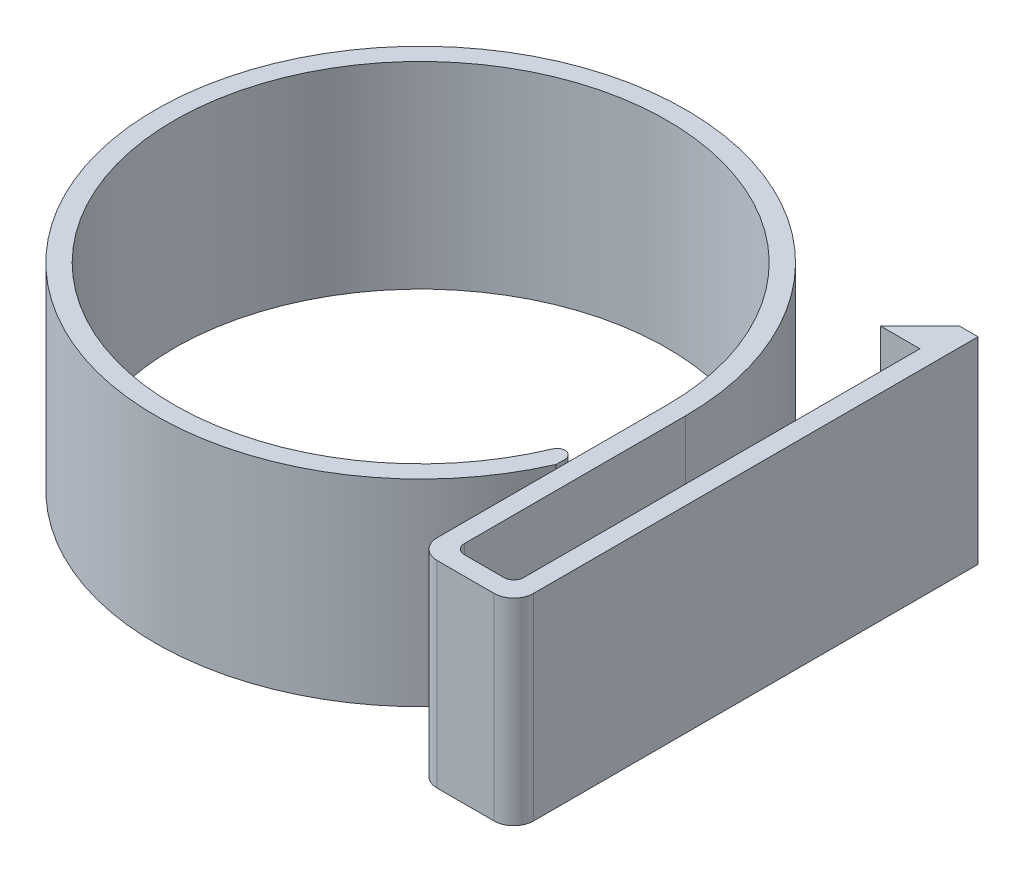
ISO-10303-21;
HEADER;
FILE_DESCRIPTION(('STEP AP214'),'2;1');
FILE_NAME('part.step','',(''),(''),'','','');
FILE_SCHEMA(('AUTOMOTIVE_DESIGN { 1 0 10303 214 1 1 1 1 }'));
ENDSEC;
DATA;
#1=APPLICATION_CONTEXT('core data for automotive mechanical design processes');
#2=APPLICATION_PROTOCOL_DEFINITION('international standard','automotive_design',2000,#1);
#3=PRODUCT_CONTEXT('',#1,'mechanical');
#4=PRODUCT('Part','Part','',(#3));
#5=PRODUCT_RELATED_PRODUCT_CATEGORY('part','',(#4));
#6=PRODUCT_DEFINITION_FORMATION('','',#4);
#7=PRODUCT_DEFINITION_CONTEXT('part definition',#1,'design');
#8=PRODUCT_DEFINITION('design','',#6,#7);
#9=PRODUCT_DEFINITION_SHAPE('','',#8);
#10=(LENGTH_UNIT() NAMED_UNIT(*) SI_UNIT(.MILLI.,.METRE.));
#11=(NAMED_UNIT(*) PLANE_ANGLE_UNIT() SI_UNIT($,.RADIAN.));
#12=(NAMED_UNIT(*) SI_UNIT($,.STERADIAN.) SOLID_ANGLE_UNIT());
#13=UNCERTAINTY_MEASURE_WITH_UNIT(LENGTH_MEASURE(1.E-05),#10,'distance_accuracy_value','');
#14=(GEOMETRIC_REPRESENTATION_CONTEXT(3) GLOBAL_UNCERTAINTY_ASSIGNED_CONTEXT((#13)) GLOBAL_UNIT_ASSIGNED_CONTEXT((#10,
#11,#12)) REPRESENTATION_CONTEXT('',''));
#15=CARTESIAN_POINT('',(0.,0.,0.));
#16=DIRECTION('',(0.,0.,1.));
#17=DIRECTION('',(1.,0.,0.));
#18=AXIS2_PLACEMENT_3D('',#15,#16,#17);
#19=CARTESIAN_POINT('',(20.885,12.7,-10.5145716596755));
#20=DIRECTION('',(1.,0.,0.));
#21=DIRECTION('',(0.,0.,-1.));
#22=AXIS2_PLACEMENT_3D('',#19,#20,#21);
#23=PLANE('',#22);
#24=DIRECTION('',(0.,0.,1.));
#25=VECTOR('',#24,1.);
#26=CARTESIAN_POINT('',(20.885,0.,-10.5145716596755));
#27=LINE('',#26,#25);
#28=CARTESIAN_POINT('',(20.885,0.,-11.2765716596755));
#29=VERTEX_POINT('',#28);
#30=CARTESIAN_POINT('',(20.885,0.,14.2504283403245));
#31=VERTEX_POINT('',#30);
#32=EDGE_CURVE('E217',#29,#31,#27,.T.);
#33=ORIENTED_EDGE('',*,*,#32,.T.);
#34=DIRECTION('',(0.,-1.,0.));
#35=VECTOR('',#34,1.);
#36=CARTESIAN_POINT('',(20.885,12.7,14.2504283403245));
#37=LINE('',#36,#35);
#38=CARTESIAN_POINT('',(20.885,12.7,14.2504283403245));
#39=VERTEX_POINT('',#38);
#40=EDGE_CURVE('E285',#31,#39,#37,.F.);
#41=ORIENTED_EDGE('',*,*,#40,.T.);
#42=DIRECTION('',(0.,0.,1.));
#43=VECTOR('',#42,1.);
#44=CARTESIAN_POINT('',(20.885,12.7,-11.2765716596755));
#45=LINE('',#44,#43);
#46=CARTESIAN_POINT('',(20.885,12.7,-11.2765716596755));
#47=VERTEX_POINT('',#46);
#48=EDGE_CURVE('E257',#47,#39,#45,.T.);
#49=ORIENTED_EDGE('',*,*,#48,.F.);
#50=DIRECTION('',(0.,-1.,0.));
#51=VECTOR('',#50,1.);
#52=CARTESIAN_POINT('',(20.885,12.7,-11.2765716596755));
#53=LINE('',#52,#51);
#54=EDGE_CURVE('E216',#47,#29,#53,.T.);
#55=ORIENTED_EDGE('',*,*,#54,.T.);
#56=EDGE_LOOP('',(#33,#41,#49,#55));
#57=FACE_BOUND('',#56,.T.);
#58=ADVANCED_FACE('F39',(#57),#23,.F.);
#59=CARTESIAN_POINT('',(20.885,12.7,14.8854283403245));
#60=DIRECTION('',(0.,0.,1.));
#61=DIRECTION('',(1.,0.,0.));
#62=AXIS2_PLACEMENT_3D('',#59,#60,#61);
#63=PLANE('',#62);
#64=DIRECTION('',(-1.,0.,0.));
#65=VECTOR('',#64,1.);
#66=CARTESIAN_POINT('',(20.885,12.7,14.8854283403245));
#67=LINE('',#66,#65);
#68=CARTESIAN_POINT('',(20.25,12.7,14.8854283403245));
#69=VERTEX_POINT('',#68);
#70=CARTESIAN_POINT('',(17.71,12.7,14.8854283403245));
#71=VERTEX_POINT('',#70);
#72=EDGE_CURVE('E171',#69,#71,#67,.T.);
#73=ORIENTED_EDGE('',*,*,#72,.F.);
#74=DIRECTION('',(0.,-1.,0.));
#75=VECTOR('',#74,1.);
#76=CARTESIAN_POINT('',(20.25,0.,14.8854283403245));
#77=LINE('',#76,#75);
#78=CARTESIAN_POINT('',(20.25,0.,14.8854283403245));
#79=VERTEX_POINT('',#78);
#80=EDGE_CURVE('E281',#69,#79,#77,.T.);
#81=ORIENTED_EDGE('',*,*,#80,.T.);
#82=DIRECTION('',(-1.,0.,0.));
#83=VECTOR('',#82,1.);
#84=CARTESIAN_POINT('',(20.885,0.,14.8854283403245));
#85=LINE('',#84,#83);
#86=CARTESIAN_POINT('',(17.71,0.,14.8854283403245));
#87=VERTEX_POINT('',#86);
#88=EDGE_CURVE('E221',#79,#87,#85,.T.);
#89=ORIENTED_EDGE('',*,*,#88,.T.);
#90=DIRECTION('',(0.,-1.,0.));
#91=VECTOR('',#90,1.);
#92=CARTESIAN_POINT('',(17.71,12.7,14.8854283403245));
#93=LINE('',#92,#91);
#94=EDGE_CURVE('E181',#87,#71,#93,.F.);
#95=ORIENTED_EDGE('',*,*,#94,.T.);
#96=EDGE_LOOP('',(#73,#81,#89,#95));
#97=FACE_BOUND('',#96,.T.);
#98=ADVANCED_FACE('F401',(#97),#63,.F.);
#99=CARTESIAN_POINT('',(17.075,12.7,0.));
#100=DIRECTION('',(-1.,0.,0.));
#101=DIRECTION('',(0.,0.,1.));
#102=AXIS2_PLACEMENT_3D('',#99,#100,#101);
#103=PLANE('',#102);
#104=DIRECTION('',(0.,0.,-1.));
#105=VECTOR('',#104,1.);
#106=CARTESIAN_POINT('',(17.075,12.7,0.));
#107=LINE('',#106,#105);
#108=CARTESIAN_POINT('',(17.075,12.7,14.2504283403245));
#109=VERTEX_POINT('',#108);
#110=CARTESIAN_POINT('',(17.075,12.7,0.));
#111=VERTEX_POINT('',#110);
#112=EDGE_CURVE('E158',#109,#111,#107,.T.);
#113=ORIENTED_EDGE('',*,*,#112,.F.);
#114=DIRECTION('',(0.,-1.,0.));
#115=VECTOR('',#114,1.);
#116=CARTESIAN_POINT('',(17.075,0.,14.2504283403245));
#117=LINE('',#116,#115);
#118=CARTESIAN_POINT('',(17.075,0.,14.2504283403245));
#119=VERTEX_POINT('',#118);
#120=EDGE_CURVE('E288',#109,#119,#117,.T.);
#121=ORIENTED_EDGE('',*,*,#120,.T.);
#122=DIRECTION('',(0.,0.,-1.));
#123=VECTOR('',#122,1.);
#124=CARTESIAN_POINT('',(17.075,0.,0.));
#125=LINE('',#124,#123);
#126=CARTESIAN_POINT('',(17.075,0.,0.));
#127=VERTEX_POINT('',#126);
#128=EDGE_CURVE('E177',#119,#127,#125,.T.);
#129=ORIENTED_EDGE('',*,*,#128,.T.);
#130=DIRECTION('',(0.,-1.,0.));
#131=VECTOR('',#130,1.);
#132=CARTESIAN_POINT('',(17.075,12.7,0.));
#133=LINE('',#132,#131);
#134=EDGE_CURVE('E174',#111,#127,#133,.T.);
#135=ORIENTED_EDGE('',*,*,#134,.F.);
#136=EDGE_LOOP('',(#113,#121,#129,#135));
#137=FACE_BOUND('',#136,.T.);
#138=ADVANCED_FACE('F175',(#137),#103,.F.);
#139=CARTESIAN_POINT('',(0.,12.7,0.));
#140=DIRECTION('',(0.,-1.,0.));
#141=DIRECTION('',(0.,0.,-1.));
#142=AXIS2_PLACEMENT_3D('',#139,#140,#141);
#143=CYLINDRICAL_SURFACE('',#142,17.075);
#144=CARTESIAN_POINT('',(0.,0.,0.));
#145=DIRECTION('',(0.,1.,0.));
#146=DIRECTION('',(0.,0.,1.));
#147=AXIS2_PLACEMENT_3D('',#144,#145,#146);
#148=CIRCLE('',#147,17.075);
#149=CARTESIAN_POINT('',(15.621,0.,6.89492451010161));
#150=VERTEX_POINT('',#149);
#151=EDGE_CURVE('E227',#127,#150,#148,.T.);
#152=ORIENTED_EDGE('',*,*,#151,.T.);
#153=DIRECTION('',(0.,-1.,0.));
#154=VECTOR('',#153,1.);
#155=CARTESIAN_POINT('',(15.621,12.7,6.89492451010161));
#156=LINE('',#155,#154);
#157=CARTESIAN_POINT('',(15.621,12.7,6.89492451010161));
#158=VERTEX_POINT('',#157);
#159=EDGE_CURVE('E182',#158,#150,#156,.T.);
#160=ORIENTED_EDGE('',*,*,#159,.F.);
#161=CARTESIAN_POINT('',(0.,12.7,0.));
#162=DIRECTION('',(0.,1.,0.));
#163=DIRECTION('',(0.,0.,1.));
#164=AXIS2_PLACEMENT_3D('',#161,#162,#163);
#165=CIRCLE('',#164,17.075);
#166=EDGE_CURVE('E162',#111,#158,#165,.T.);
#167=ORIENTED_EDGE('',*,*,#166,.F.);
#168=ORIENTED_EDGE('',*,*,#134,.T.);
#169=EDGE_LOOP('',(#152,#160,#167,#168));
#170=FACE_BOUND('',#169,.T.);
#171=ADVANCED_FACE('F184',(#170),#143,.T.);
#172=CARTESIAN_POINT('',(15.621,12.7,6.89492451010161));
#173=DIRECTION('',(-1.,0.,0.));
#174=DIRECTION('',(0.,0.,1.));
#175=AXIS2_PLACEMENT_3D('',#172,#173,#174);
#176=PLANE('',#175);
#177=DIRECTION('',(0.,0.,-1.));
#178=VECTOR('',#177,1.);
#179=CARTESIAN_POINT('',(15.621,0.,6.89492451010161));
#180=LINE('',#179,#178);
#181=CARTESIAN_POINT('',(15.621,0.,6.32454899577828));
#182=VERTEX_POINT('',#181);
#183=EDGE_CURVE('E230',#150,#182,#180,.T.);
#184=ORIENTED_EDGE('',*,*,#183,.T.);
#185=DIRECTION('',(0.,-1.,0.));
#186=VECTOR('',#185,1.);
#187=CARTESIAN_POINT('',(15.621,12.7,6.32454899577828));
#188=LINE('',#187,#186);
#189=CARTESIAN_POINT('',(15.621,12.7,6.32454899577828));
#190=VERTEX_POINT('',#189);
#191=EDGE_CURVE('E48',#182,#190,#188,.F.);
#192=ORIENTED_EDGE('',*,*,#191,.T.);
#193=DIRECTION('',(0.,0.,-1.));
#194=VECTOR('',#193,1.);
#195=CARTESIAN_POINT('',(15.621,12.7,6.89492451010161));
#196=LINE('',#195,#194);
#197=EDGE_CURVE('E187',#158,#190,#196,.T.);
#198=ORIENTED_EDGE('',*,*,#197,.F.);
#199=ORIENTED_EDGE('',*,*,#159,.T.);
#200=EDGE_LOOP('',(#184,#192,#198,#199));
#201=FACE_BOUND('',#200,.T.);
#202=ADVANCED_FACE('F395',(#201),#176,.F.);
#203=CARTESIAN_POINT('',(0.,12.7,0.));
#204=DIRECTION('',(0.,-1.,0.));
#205=DIRECTION('',(0.,0.,-1.));
#206=AXIS2_PLACEMENT_3D('',#203,#204,#205);
#207=CYLINDRICAL_SURFACE('',#206,15.875);
#208=CARTESIAN_POINT('',(0.,12.7,0.));
#209=DIRECTION('',(0.,-1.,0.));
#210=DIRECTION('',(0.,0.,1.));
#211=AXIS2_PLACEMENT_3D('',#208,#209,#210);
#212=CIRCLE('',#211,15.875);
#213=CARTESIAN_POINT('',(14.6443798449612,12.7,6.12843894939755));
#214=VERTEX_POINT('',#213);
#215=CARTESIAN_POINT('',(15.875,12.7,0.));
#216=VERTEX_POINT('',#215);
#217=EDGE_CURVE('E190',#214,#216,#212,.T.);
#218=ORIENTED_EDGE('',*,*,#217,.F.);
#219=DIRECTION('',(0.,-1.,0.));
#220=VECTOR('',#219,1.);
#221=CARTESIAN_POINT('',(14.6443798449612,12.7,6.12843894939756));
#222=LINE('',#221,#220);
#223=CARTESIAN_POINT('',(14.6443798449612,0.,6.12843894939755));
#224=VERTEX_POINT('',#223);
#225=EDGE_CURVE('E328',#214,#224,#222,.T.);
#226=ORIENTED_EDGE('',*,*,#225,.T.);
#227=CARTESIAN_POINT('',(0.,0.,0.));
#228=DIRECTION('',(0.,-1.,0.));
#229=DIRECTION('',(0.,0.,1.));
#230=AXIS2_PLACEMENT_3D('',#227,#228,#229);
#231=CIRCLE('',#230,15.875);
#232=CARTESIAN_POINT('',(15.875,0.,0.));
#233=VERTEX_POINT('',#232);
#234=EDGE_CURVE('E233',#224,#233,#231,.T.);
#235=ORIENTED_EDGE('',*,*,#234,.T.);
#236=DIRECTION('',(0.,-1.,0.));
#237=VECTOR('',#236,1.);
#238=CARTESIAN_POINT('',(15.875,12.7,0.));
#239=LINE('',#238,#237);
#240=EDGE_CURVE('E273',#216,#233,#239,.T.);
#241=ORIENTED_EDGE('',*,*,#240,.F.);
#242=EDGE_LOOP('',(#218,#226,#235,#241));
#243=FACE_BOUND('',#242,.T.);
#244=ADVANCED_FACE('F337',(#243),#207,.F.);
#245=CARTESIAN_POINT('',(15.875,12.7,0.));
#246=DIRECTION('',(1.,0.,0.));
#247=DIRECTION('',(0.,0.,-1.));
#248=AXIS2_PLACEMENT_3D('',#245,#246,#247);
#249=PLANE('',#248);
#250=DIRECTION('',(0.,0.,1.));
#251=VECTOR('',#250,1.);
#252=CARTESIAN_POINT('',(15.875,0.,0.));
#253=LINE('',#252,#251);
#254=CARTESIAN_POINT('',(15.875,0.,14.8154283403245));
#255=VERTEX_POINT('',#254);
#256=EDGE_CURVE('E236',#233,#255,#253,.T.);
#257=ORIENTED_EDGE('',*,*,#256,.T.);
#258=DIRECTION('',(0.,-1.,0.));
#259=VECTOR('',#258,1.);
#260=CARTESIAN_POINT('',(15.875,12.7,14.8154283403245));
#261=LINE('',#260,#259);
#262=CARTESIAN_POINT('',(15.875,12.7,14.8154283403245));
#263=VERTEX_POINT('',#262);
#264=EDGE_CURVE('E325',#255,#263,#261,.F.);
#265=ORIENTED_EDGE('',*,*,#264,.T.);
#266=DIRECTION('',(0.,0.,1.));
#267=VECTOR('',#266,1.);
#268=CARTESIAN_POINT('',(15.875,12.7,0.));
#269=LINE('',#268,#267);
#270=EDGE_CURVE('E196',#216,#263,#269,.T.);
#271=ORIENTED_EDGE('',*,*,#270,.F.);
#272=ORIENTED_EDGE('',*,*,#240,.T.);
#273=EDGE_LOOP('',(#257,#265,#271,#272));
#274=FACE_BOUND('',#273,.T.);
#275=ADVANCED_FACE('F346',(#274),#249,.F.);
#276=CARTESIAN_POINT('',(15.875,12.7,16.0854283403245));
#277=DIRECTION('',(0.,0.,-1.));
#278=DIRECTION('',(-1.,0.,0.));
#279=AXIS2_PLACEMENT_3D('',#276,#277,#278);
#280=PLANE('',#279);
#281=DIRECTION('',(1.,0.,0.));
#282=VECTOR('',#281,1.);
#283=CARTESIAN_POINT('',(15.875,0.,16.0854283403245));
#284=LINE('',#283,#282);
#285=CARTESIAN_POINT('',(17.145,0.,16.0854283403245));
#286=VERTEX_POINT('',#285);
#287=CARTESIAN_POINT('',(20.815,0.,16.0854283403245));
#288=VERTEX_POINT('',#287);
#289=EDGE_CURVE('E240',#286,#288,#284,.T.);
#290=ORIENTED_EDGE('',*,*,#289,.T.);
#291=DIRECTION('',(0.,-1.,0.));
#292=VECTOR('',#291,1.);
#293=CARTESIAN_POINT('',(20.815,12.7,16.0854283403245));
#294=LINE('',#293,#292);
#295=CARTESIAN_POINT('',(20.815,12.7,16.0854283403245));
#296=VERTEX_POINT('',#295);
#297=EDGE_CURVE('E316',#288,#296,#294,.F.);
#298=ORIENTED_EDGE('',*,*,#297,.T.);
#299=DIRECTION('',(1.,0.,0.));
#300=VECTOR('',#299,1.);
#301=CARTESIAN_POINT('',(15.875,12.7,16.0854283403245));
#302=LINE('',#301,#300);
#303=CARTESIAN_POINT('',(17.145,12.7,16.0854283403245));
#304=VERTEX_POINT('',#303);
#305=EDGE_CURVE('E200',#304,#296,#302,.T.);
#306=ORIENTED_EDGE('',*,*,#305,.F.);
#307=DIRECTION('',(0.,-1.,0.));
#308=VECTOR('',#307,1.);
#309=CARTESIAN_POINT('',(17.145,12.7,16.0854283403245));
#310=LINE('',#309,#308);
#311=EDGE_CURVE('E312',#304,#286,#310,.T.);
#312=ORIENTED_EDGE('',*,*,#311,.T.);
#313=EDGE_LOOP('',(#290,#298,#306,#312));
#314=FACE_BOUND('',#313,.T.);
#315=ADVANCED_FACE('F355',(#314),#280,.F.);
#316=CARTESIAN_POINT('',(22.085,12.7,-13.8165716596754));
#317=DIRECTION('',(-1.,0.,0.));
#318=DIRECTION('',(0.,0.,1.));
#319=AXIS2_PLACEMENT_3D('',#316,#317,#318);
#320=PLANE('',#319);
#321=DIRECTION('',(0.,0.,-1.));
#322=VECTOR('',#321,1.);
#323=CARTESIAN_POINT('',(22.085,12.7,16.0854283403245));
#324=LINE('',#323,#322);
#325=CARTESIAN_POINT('',(22.085,12.7,14.8154283403245));
#326=VERTEX_POINT('',#325);
#327=CARTESIAN_POINT('',(22.085,12.7,-13.8165716596754));
#328=VERTEX_POINT('',#327);
#329=EDGE_CURVE('E204',#326,#328,#324,.T.);
#330=ORIENTED_EDGE('',*,*,#329,.F.);
#331=DIRECTION('',(0.,-1.,0.));
#332=VECTOR('',#331,1.);
#333=CARTESIAN_POINT('',(22.085,12.7,14.8154283403245));
#334=LINE('',#333,#332);
#335=CARTESIAN_POINT('',(22.085,0.,14.8154283403245));
#336=VERTEX_POINT('',#335);
#337=EDGE_CURVE('E302',#326,#336,#334,.T.);
#338=ORIENTED_EDGE('',*,*,#337,.T.);
#339=DIRECTION('',(0.,0.,-1.));
#340=VECTOR('',#339,1.);
#341=CARTESIAN_POINT('',(22.085,0.,-13.8165716596754));
#342=LINE('',#341,#340);
#343=CARTESIAN_POINT('',(22.085,0.,-13.8165716596754));
#344=VERTEX_POINT('',#343);
#345=EDGE_CURVE('E244',#336,#344,#342,.T.);
#346=ORIENTED_EDGE('',*,*,#345,.T.);
#347=DIRECTION('',(0.,-1.,0.));
#348=VECTOR('',#347,1.);
#349=CARTESIAN_POINT('',(22.085,12.7,-13.8165716596754));
#350=LINE('',#349,#348);
#351=EDGE_CURVE('E269',#328,#344,#350,.T.);
#352=ORIENTED_EDGE('',*,*,#351,.F.);
#353=EDGE_LOOP('',(#330,#338,#346,#352));
#354=FACE_BOUND('',#353,.T.);
#355=ADVANCED_FACE('F363',(#354),#320,.F.);
#356=CARTESIAN_POINT('',(20.885,12.7,-13.8165716596754));
#357=DIRECTION('',(0.,0.,1.));
#358=DIRECTION('',(1.,0.,0.));
#359=AXIS2_PLACEMENT_3D('',#356,#357,#358);
#360=PLANE('',#359);
#361=DIRECTION('',(-1.,0.,0.));
#362=VECTOR('',#361,1.);
#363=CARTESIAN_POINT('',(20.885,0.,-13.8165716596754));
#364=LINE('',#363,#362);
#365=CARTESIAN_POINT('',(20.885,0.,-13.8165716596754));
#366=VERTEX_POINT('',#365);
#367=EDGE_CURVE('E247',#344,#366,#364,.T.);
#368=ORIENTED_EDGE('',*,*,#367,.T.);
#369=DIRECTION('',(0.,-1.,0.));
#370=VECTOR('',#369,1.);
#371=CARTESIAN_POINT('',(20.885,12.7,-13.8165716596754));
#372=LINE('',#371,#370);
#373=CARTESIAN_POINT('',(20.885,12.7,-13.8165716596754));
#374=VERTEX_POINT('',#373);
#375=EDGE_CURVE('E265',#374,#366,#372,.T.);
#376=ORIENTED_EDGE('',*,*,#375,.F.);
#377=DIRECTION('',(-1.,0.,0.));
#378=VECTOR('',#377,1.);
#379=CARTESIAN_POINT('',(20.885,12.7,-13.8165716596754));
#380=LINE('',#379,#378);
#381=EDGE_CURVE('E207',#328,#374,#380,.T.);
#382=ORIENTED_EDGE('',*,*,#381,.F.);
#383=ORIENTED_EDGE('',*,*,#351,.T.);
#384=EDGE_LOOP('',(#368,#376,#382,#383));
#385=FACE_BOUND('',#384,.T.);
#386=ADVANCED_FACE('F369',(#385),#360,.F.);
#387=CARTESIAN_POINT('',(18.345,12.7,-11.2765716596755));
#388=DIRECTION('',(0.707106781186544,0.,0.707106781186551));
#389=DIRECTION('',(0.707106781186551,0.,-0.707106781186544));
#390=AXIS2_PLACEMENT_3D('',#387,#388,#389);
#391=PLANE('',#390);
#392=DIRECTION('',(-0.707106781186551,0.,0.707106781186544));
#393=VECTOR('',#392,1.);
#394=CARTESIAN_POINT('',(18.345,0.,-11.2765716596755));
#395=LINE('',#394,#393);
#396=CARTESIAN_POINT('',(18.345,0.,-11.2765716596755));
#397=VERTEX_POINT('',#396);
#398=EDGE_CURVE('E250',#366,#397,#395,.T.);
#399=ORIENTED_EDGE('',*,*,#398,.T.);
#400=DIRECTION('',(0.,-1.,0.));
#401=VECTOR('',#400,1.);
#402=CARTESIAN_POINT('',(18.345,12.7,-11.2765716596755));
#403=LINE('',#402,#401);
#404=CARTESIAN_POINT('',(18.345,12.7,-11.2765716596755));
#405=VERTEX_POINT('',#404);
#406=EDGE_CURVE('E261',#405,#397,#403,.T.);
#407=ORIENTED_EDGE('',*,*,#406,.F.);
#408=DIRECTION('',(-0.707106781186551,0.,0.707106781186544));
#409=VECTOR('',#408,1.);
#410=CARTESIAN_POINT('',(18.345,12.7,-11.2765716596755));
#411=LINE('',#410,#409);
#412=EDGE_CURVE('E210',#374,#405,#411,.T.);
#413=ORIENTED_EDGE('',*,*,#412,.F.);
#414=ORIENTED_EDGE('',*,*,#375,.T.);
#415=EDGE_LOOP('',(#399,#407,#413,#414));
#416=FACE_BOUND('',#415,.T.);
#417=ADVANCED_FACE('F376',(#416),#391,.F.);
#418=CARTESIAN_POINT('',(20.885,12.7,-11.2765716596755));
#419=DIRECTION('',(0.,0.,-1.));
#420=DIRECTION('',(-1.,0.,0.));
#421=AXIS2_PLACEMENT_3D('',#418,#419,#420);
#422=PLANE('',#421);
#423=DIRECTION('',(1.,0.,0.));
#424=VECTOR('',#423,1.);
#425=CARTESIAN_POINT('',(20.885,0.,-11.2765716596755));
#426=LINE('',#425,#424);
#427=EDGE_CURVE('E253',#397,#29,#426,.T.);
#428=ORIENTED_EDGE('',*,*,#427,.T.);
#429=ORIENTED_EDGE('',*,*,#54,.F.);
#430=DIRECTION('',(1.,0.,0.));
#431=VECTOR('',#430,1.);
#432=CARTESIAN_POINT('',(20.885,12.7,-11.2765716596755));
#433=LINE('',#432,#431);
#434=EDGE_CURVE('E213',#405,#47,#433,.T.);
#435=ORIENTED_EDGE('',*,*,#434,.F.);
#436=ORIENTED_EDGE('',*,*,#406,.T.);
#437=EDGE_LOOP('',(#428,#429,#435,#436));
#438=FACE_BOUND('',#437,.T.);
#439=ADVANCED_FACE('F380',(#438),#422,.F.);
#440=CARTESIAN_POINT('',(0.,12.7,0.));
#441=DIRECTION('',(0.,1.,0.));
#442=DIRECTION('',(0.,0.,1.));
#443=AXIS2_PLACEMENT_3D('',#440,#441,#442);
#444=PLANE('',#443);
#445=ORIENTED_EDGE('',*,*,#197,.T.);
#446=CARTESIAN_POINT('',(15.113,12.7,6.32454899577828));
#447=DIRECTION('',(0.,1.,0.));
#448=DIRECTION('',(0.,0.,1.));
#449=AXIS2_PLACEMENT_3D('',#446,#447,#448);
#450=CIRCLE('',#449,0.508);
#451=EDGE_CURVE('E11',#190,#214,#450,.T.);
#452=ORIENTED_EDGE('',*,*,#451,.T.);
#453=ORIENTED_EDGE('',*,*,#217,.T.);
#454=ORIENTED_EDGE('',*,*,#270,.T.);
#455=CARTESIAN_POINT('',(17.145,12.7,14.8154283403245));
#456=DIRECTION('',(0.,1.,0.));
#457=DIRECTION('',(0.,0.,1.));
#458=AXIS2_PLACEMENT_3D('',#455,#456,#457);
#459=CIRCLE('',#458,1.27);
#460=EDGE_CURVE('E319',#263,#304,#459,.T.);
#461=ORIENTED_EDGE('',*,*,#460,.T.);
#462=ORIENTED_EDGE('',*,*,#305,.T.);
#463=CARTESIAN_POINT('',(20.815,12.7,14.8154283403245));
#464=DIRECTION('',(0.,1.,0.));
#465=DIRECTION('',(0.,0.,1.));
#466=AXIS2_PLACEMENT_3D('',#463,#464,#465);
#467=CIRCLE('',#466,1.27);
#468=EDGE_CURVE('E322',#296,#326,#467,.T.);
#469=ORIENTED_EDGE('',*,*,#468,.T.);
#470=ORIENTED_EDGE('',*,*,#329,.T.);
#471=ORIENTED_EDGE('',*,*,#381,.T.);
#472=ORIENTED_EDGE('',*,*,#412,.T.);
#473=ORIENTED_EDGE('',*,*,#434,.T.);
#474=ORIENTED_EDGE('',*,*,#48,.T.);
#475=CARTESIAN_POINT('',(20.25,12.7,14.2504283403245));
#476=DIRECTION('',(0.,1.,0.));
#477=DIRECTION('',(0.,0.,1.));
#478=AXIS2_PLACEMENT_3D('',#475,#476,#477);
#479=CIRCLE('',#478,0.635);
#480=EDGE_CURVE('E294',#39,#69,#479,.F.);
#481=ORIENTED_EDGE('',*,*,#480,.T.);
#482=ORIENTED_EDGE('',*,*,#72,.T.);
#483=CARTESIAN_POINT('',(17.71,12.7,14.2504283403245));
#484=DIRECTION('',(0.,1.,0.));
#485=DIRECTION('',(0.,0.,1.));
#486=AXIS2_PLACEMENT_3D('',#483,#484,#485);
#487=CIRCLE('',#486,0.635);
#488=EDGE_CURVE('E166',#71,#109,#487,.F.);
#489=ORIENTED_EDGE('',*,*,#488,.T.);
#490=ORIENTED_EDGE('',*,*,#112,.T.);
#491=ORIENTED_EDGE('',*,*,#166,.T.);
#492=EDGE_LOOP('',(#445,#452,#453,#454,#461,#462,#469,#470,#471,#472,#473,#474,#481,#482,#489,
#490,#491));
#493=FACE_BOUND('',#492,.T.);
#494=ADVANCED_FACE('F160',(#493),#444,.T.);
#495=CARTESIAN_POINT('',(0.,0.,0.));
#496=DIRECTION('',(0.,1.,0.));
#497=DIRECTION('',(0.,0.,1.));
#498=AXIS2_PLACEMENT_3D('',#495,#496,#497);
#499=PLANE('',#498);
#500=ORIENTED_EDGE('',*,*,#234,.F.);
#501=CARTESIAN_POINT('',(15.113,0.,6.32454899577828));
#502=DIRECTION('',(0.,1.,0.));
#503=DIRECTION('',(0.,0.,1.));
#504=AXIS2_PLACEMENT_3D('',#501,#502,#503);
#505=CIRCLE('',#504,0.508);
#506=EDGE_CURVE('E62',#224,#182,#505,.F.);
#507=ORIENTED_EDGE('',*,*,#506,.T.);
#508=ORIENTED_EDGE('',*,*,#183,.F.);
#509=ORIENTED_EDGE('',*,*,#151,.F.);
#510=ORIENTED_EDGE('',*,*,#128,.F.);
#511=CARTESIAN_POINT('',(17.71,0.,14.2504283403245));
#512=DIRECTION('',(0.,1.,0.));
#513=DIRECTION('',(0.,0.,1.));
#514=AXIS2_PLACEMENT_3D('',#511,#512,#513);
#515=CIRCLE('',#514,0.635);
#516=EDGE_CURVE('E297',#119,#87,#515,.T.);
#517=ORIENTED_EDGE('',*,*,#516,.T.);
#518=ORIENTED_EDGE('',*,*,#88,.F.);
#519=CARTESIAN_POINT('',(20.25,0.,14.2504283403245));
#520=DIRECTION('',(0.,1.,0.));
#521=DIRECTION('',(0.,0.,1.));
#522=AXIS2_PLACEMENT_3D('',#519,#520,#521);
#523=CIRCLE('',#522,0.635);
#524=EDGE_CURVE('E291',#79,#31,#523,.T.);
#525=ORIENTED_EDGE('',*,*,#524,.T.);
#526=ORIENTED_EDGE('',*,*,#32,.F.);
#527=ORIENTED_EDGE('',*,*,#427,.F.);
#528=ORIENTED_EDGE('',*,*,#398,.F.);
#529=ORIENTED_EDGE('',*,*,#367,.F.);
#530=ORIENTED_EDGE('',*,*,#345,.F.);
#531=CARTESIAN_POINT('',(20.815,0.,14.8154283403245));
#532=DIRECTION('',(0.,1.,0.));
#533=DIRECTION('',(0.,0.,1.));
#534=AXIS2_PLACEMENT_3D('',#531,#532,#533);
#535=CIRCLE('',#534,1.27);
#536=EDGE_CURVE('E309',#336,#288,#535,.F.);
#537=ORIENTED_EDGE('',*,*,#536,.T.);
#538=ORIENTED_EDGE('',*,*,#289,.F.);
#539=CARTESIAN_POINT('',(17.145,0.,14.8154283403245));
#540=DIRECTION('',(0.,1.,0.));
#541=DIRECTION('',(0.,0.,1.));
#542=AXIS2_PLACEMENT_3D('',#539,#540,#541);
#543=CIRCLE('',#542,1.27);
#544=EDGE_CURVE('E306',#286,#255,#543,.F.);
#545=ORIENTED_EDGE('',*,*,#544,.T.);
#546=ORIENTED_EDGE('',*,*,#256,.F.);
#547=EDGE_LOOP('',(#500,#507,#508,#509,#510,#517,#518,#525,#526,#527,#528,#529,#530,#537,#538,
#545,#546));
#548=FACE_BOUND('',#547,.T.);
#549=ADVANCED_FACE('F342',(#548),#499,.F.);
#550=CARTESIAN_POINT('',(20.25,12.7,14.2504283403245));
#551=DIRECTION('',(0.,1.,0.));
#552=DIRECTION('',(0.,0.,1.));
#553=AXIS2_PLACEMENT_3D('',#550,#551,#552);
#554=CYLINDRICAL_SURFACE('',#553,0.635);
#555=ORIENTED_EDGE('',*,*,#480,.F.);
#556=ORIENTED_EDGE('',*,*,#40,.F.);
#557=ORIENTED_EDGE('',*,*,#524,.F.);
#558=ORIENTED_EDGE('',*,*,#80,.F.);
#559=EDGE_LOOP('',(#555,#556,#557,#558));
#560=FACE_BOUND('',#559,.T.);
#561=ADVANCED_FACE('F409',(#560),#554,.F.);
#562=CARTESIAN_POINT('',(17.71,12.7,14.2504283403245));
#563=DIRECTION('',(0.,1.,0.));
#564=DIRECTION('',(0.,0.,1.));
#565=AXIS2_PLACEMENT_3D('',#562,#563,#564);
#566=CYLINDRICAL_SURFACE('',#565,0.635);
#567=ORIENTED_EDGE('',*,*,#488,.F.);
#568=ORIENTED_EDGE('',*,*,#94,.F.);
#569=ORIENTED_EDGE('',*,*,#516,.F.);
#570=ORIENTED_EDGE('',*,*,#120,.F.);
#571=EDGE_LOOP('',(#567,#568,#569,#570));
#572=FACE_BOUND('',#571,.T.);
#573=ADVANCED_FACE('F393',(#572),#566,.F.);
#574=CARTESIAN_POINT('',(20.815,12.7,14.8154283403245));
#575=DIRECTION('',(0.,-1.,0.));
#576=DIRECTION('',(0.,0.,-1.));
#577=AXIS2_PLACEMENT_3D('',#574,#575,#576);
#578=CYLINDRICAL_SURFACE('',#577,1.27);
#579=ORIENTED_EDGE('',*,*,#468,.F.);
#580=ORIENTED_EDGE('',*,*,#297,.F.);
#581=ORIENTED_EDGE('',*,*,#536,.F.);
#582=ORIENTED_EDGE('',*,*,#337,.F.);
#583=EDGE_LOOP('',(#579,#580,#581,#582));
#584=FACE_BOUND('',#583,.T.);
#585=ADVANCED_FACE('F358',(#584),#578,.T.);
#586=CARTESIAN_POINT('',(17.145,12.7,14.8154283403245));
#587=DIRECTION('',(0.,-1.,0.));
#588=DIRECTION('',(0.,0.,-1.));
#589=AXIS2_PLACEMENT_3D('',#586,#587,#588);
#590=CYLINDRICAL_SURFACE('',#589,1.27);
#591=ORIENTED_EDGE('',*,*,#460,.F.);
#592=ORIENTED_EDGE('',*,*,#264,.F.);
#593=ORIENTED_EDGE('',*,*,#544,.F.);
#594=ORIENTED_EDGE('',*,*,#311,.F.);
#595=EDGE_LOOP('',(#591,#592,#593,#594));
#596=FACE_BOUND('',#595,.T.);
#597=ADVANCED_FACE('F350',(#596),#590,.T.);
#598=CARTESIAN_POINT('',(15.113,12.7,6.32454899577828));
#599=DIRECTION('',(0.,-1.,0.));
#600=DIRECTION('',(0.,0.,-1.));
#601=AXIS2_PLACEMENT_3D('',#598,#599,#600);
#602=CYLINDRICAL_SURFACE('',#601,0.508);
#603=ORIENTED_EDGE('',*,*,#451,.F.);
#604=ORIENTED_EDGE('',*,*,#191,.F.);
#605=ORIENTED_EDGE('',*,*,#506,.F.);
#606=ORIENTED_EDGE('',*,*,#225,.F.);
#607=EDGE_LOOP('',(#603,#604,#605,#606));
#608=FACE_BOUND('',#607,.T.);
#609=ADVANCED_FACE('F41',(#608),#602,.T.);
#610=CLOSED_SHELL('',(#58,#98,#138,#171,#202,#244,#275,#315,#355,#386,#417,#439,#494,#549,#561,
#573,#585,#597,#609));
#611=MANIFOLD_SOLID_BREP('B2',#610);
#612=ADVANCED_BREP_SHAPE_REPRESENTATION('',(#18,#611),#14);
#613=SHAPE_DEFINITION_REPRESENTATION(#9,#612);
ENDSEC;
END-ISO-10303-21;
